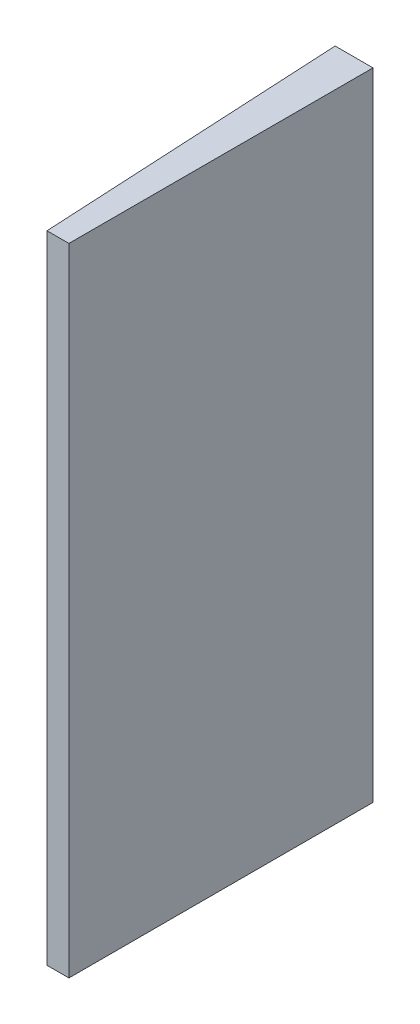
ISO-10303-21;
HEADER;
FILE_DESCRIPTION(('STEP AP214'),'2;1');
FILE_NAME('part.step','',(''),(''),'','','');
FILE_SCHEMA(('AUTOMOTIVE_DESIGN { 1 0 10303 214 1 1 1 1 }'));
ENDSEC;
DATA;
#1=APPLICATION_CONTEXT('core data for automotive mechanical design processes');
#2=APPLICATION_PROTOCOL_DEFINITION('international standard','automotive_design',2000,#1);
#3=PRODUCT_CONTEXT('',#1,'mechanical');
#4=PRODUCT('Part','Part','',(#3));
#5=PRODUCT_RELATED_PRODUCT_CATEGORY('part','',(#4));
#6=PRODUCT_DEFINITION_FORMATION('','',#4);
#7=PRODUCT_DEFINITION_CONTEXT('part definition',#1,'design');
#8=PRODUCT_DEFINITION('design','',#6,#7);
#9=PRODUCT_DEFINITION_SHAPE('','',#8);
#10=(LENGTH_UNIT() NAMED_UNIT(*) SI_UNIT(.MILLI.,.METRE.));
#11=(NAMED_UNIT(*) PLANE_ANGLE_UNIT() SI_UNIT($,.RADIAN.));
#12=(NAMED_UNIT(*) SI_UNIT($,.STERADIAN.) SOLID_ANGLE_UNIT());
#13=UNCERTAINTY_MEASURE_WITH_UNIT(LENGTH_MEASURE(1.E-05),#10,'distance_accuracy_value','');
#14=(GEOMETRIC_REPRESENTATION_CONTEXT(3) GLOBAL_UNCERTAINTY_ASSIGNED_CONTEXT((#13)) GLOBAL_UNIT_ASSIGNED_CONTEXT((#10,
#11,#12)) REPRESENTATION_CONTEXT('',''));
#15=CARTESIAN_POINT('',(0.,0.,0.));
#16=DIRECTION('',(0.,0.,1.));
#17=DIRECTION('',(1.,0.,0.));
#18=AXIS2_PLACEMENT_3D('',#15,#16,#17);
#19=CARTESIAN_POINT('',(0.,42.,-20.075));
#20=DIRECTION('',(0.,0.,1.));
#21=DIRECTION('',(1.,0.,0.));
#22=AXIS2_PLACEMENT_3D('',#19,#20,#21);
#23=PLANE('',#22);
#24=DIRECTION('',(-1.,0.,0.));
#25=VECTOR('',#24,1.);
#26=CARTESIAN_POINT('',(0.,-42.,-20.075));
#27=LINE('',#26,#25);
#28=CARTESIAN_POINT('',(0.,-42.,-20.075));
#29=VERTEX_POINT('',#28);
#30=CARTESIAN_POINT('',(-5.,-42.,-20.075));
#31=VERTEX_POINT('',#30);
#32=EDGE_CURVE('E106',#29,#31,#27,.T.);
#33=ORIENTED_EDGE('',*,*,#32,.T.);
#34=DIRECTION('',(0.,-1.,0.));
#35=VECTOR('',#34,1.);
#36=CARTESIAN_POINT('',(-5.,42.,-20.075));
#37=LINE('',#36,#35);
#38=CARTESIAN_POINT('',(-5.,42.,-20.075));
#39=VERTEX_POINT('',#38);
#40=EDGE_CURVE('E97',#39,#31,#37,.T.);
#41=ORIENTED_EDGE('',*,*,#40,.F.);
#42=DIRECTION('',(-1.,0.,0.));
#43=VECTOR('',#42,1.);
#44=CARTESIAN_POINT('',(0.,42.,-20.075));
#45=LINE('',#44,#43);
#46=CARTESIAN_POINT('',(0.,42.,-20.075));
#47=VERTEX_POINT('',#46);
#48=EDGE_CURVE('E91',#47,#39,#45,.T.);
#49=ORIENTED_EDGE('',*,*,#48,.F.);
#50=DIRECTION('',(0.,-1.,0.));
#51=VECTOR('',#50,1.);
#52=CARTESIAN_POINT('',(0.,42.,-20.075));
#53=LINE('',#52,#51);
#54=EDGE_CURVE('E102',#47,#29,#53,.T.);
#55=ORIENTED_EDGE('',*,*,#54,.T.);
#56=EDGE_LOOP('',(#33,#41,#49,#55));
#57=FACE_BOUND('',#56,.T.);
#58=ADVANCED_FACE('F39',(#57),#23,.F.);
#59=CARTESIAN_POINT('',(-5.,42.,-20.075));
#60=DIRECTION('',(0.998629534754574,0.,-0.0523359562429404));
#61=DIRECTION('',(-0.0523359562429404,0.,-0.998629534754574));
#62=AXIS2_PLACEMENT_3D('',#59,#60,#61);
#63=PLANE('',#62);
#64=CARTESIAN_POINT('',(-4.20449346510731,29.8956518577535,-4.89583107173047));
#65=DIRECTION('',(0.998629534754574,0.,-0.0523359562429404));
#66=DIRECTION('',(-0.0523359562429404,0.,-0.998629534754574));
#67=AXIS2_PLACEMENT_3D('',#64,#65,#66);
#68=CIRCLE('',#67,3.3);
#69=CARTESIAN_POINT('',(-4.37720212070901,29.8956518577535,-8.19130853642057));
#70=VERTEX_POINT('',#69);
#71=EDGE_CURVE('E11',#70,#70,#68,.F.);
#72=ORIENTED_EDGE('',*,*,#71,.F.);
#73=EDGE_LOOP('',(#72));
#74=FACE_BOUND('',#73,.T.);
#75=CARTESIAN_POINT('',(-4.20449346510731,-29.8956518577535,-4.89583107173047));
#76=DIRECTION('',(0.998629534754574,0.,-0.0523359562429404));
#77=DIRECTION('',(-0.0523359562429404,0.,-0.998629534754574));
#78=AXIS2_PLACEMENT_3D('',#75,#76,#77);
#79=CIRCLE('',#78,3.3);
#80=CARTESIAN_POINT('',(-4.37720212070901,-29.8956518577535,-8.19130853642057));
#81=VERTEX_POINT('',#80);
#82=EDGE_CURVE('E47',#81,#81,#79,.F.);
#83=ORIENTED_EDGE('',*,*,#82,.F.);
#84=EDGE_LOOP('',(#83));
#85=FACE_BOUND('',#84,.T.);
#86=DIRECTION('',(0.0523359562429404,0.,0.998629534754574));
#87=VECTOR('',#86,1.);
#88=CARTESIAN_POINT('',(-5.,-42.,-20.075));
#89=LINE('',#88,#87);
#90=CARTESIAN_POINT('',(-2.89582766178603,-42.,20.075));
#91=VERTEX_POINT('',#90);
#92=EDGE_CURVE('E96',#31,#91,#89,.T.);
#93=ORIENTED_EDGE('',*,*,#92,.T.);
#94=DIRECTION('',(0.,-1.,0.));
#95=VECTOR('',#94,1.);
#96=CARTESIAN_POINT('',(-2.89582766178603,42.,20.075));
#97=LINE('',#96,#95);
#98=CARTESIAN_POINT('',(-2.89582766178603,42.,20.075));
#99=VERTEX_POINT('',#98);
#100=EDGE_CURVE('E94',#99,#91,#97,.T.);
#101=ORIENTED_EDGE('',*,*,#100,.F.);
#102=DIRECTION('',(0.0523359562429404,0.,0.998629534754574));
#103=VECTOR('',#102,1.);
#104=CARTESIAN_POINT('',(-5.,42.,-20.075));
#105=LINE('',#104,#103);
#106=EDGE_CURVE('E86',#39,#99,#105,.T.);
#107=ORIENTED_EDGE('',*,*,#106,.F.);
#108=ORIENTED_EDGE('',*,*,#40,.T.);
#109=EDGE_LOOP('',(#93,#101,#107,#108));
#110=FACE_BOUND('',#109,.T.);
#111=ADVANCED_FACE('F95',(#74,#85,#110),#63,.F.);
#112=CARTESIAN_POINT('',(-2.89582766178603,42.,20.075));
#113=DIRECTION('',(0.,0.,-1.));
#114=DIRECTION('',(-1.,0.,0.));
#115=AXIS2_PLACEMENT_3D('',#112,#113,#114);
#116=PLANE('',#115);
#117=DIRECTION('',(1.,0.,0.));
#118=VECTOR('',#117,1.);
#119=CARTESIAN_POINT('',(-2.89582766178603,-42.,20.075));
#120=LINE('',#119,#118);
#121=CARTESIAN_POINT('',(0.,-42.,20.075));
#122=VERTEX_POINT('',#121);
#123=EDGE_CURVE('E72',#91,#122,#120,.T.);
#124=ORIENTED_EDGE('',*,*,#123,.T.);
#125=DIRECTION('',(0.,-1.,0.));
#126=VECTOR('',#125,1.);
#127=CARTESIAN_POINT('',(0.,42.,20.075));
#128=LINE('',#127,#126);
#129=CARTESIAN_POINT('',(0.,42.,20.075));
#130=VERTEX_POINT('',#129);
#131=EDGE_CURVE('E98',#130,#122,#128,.T.);
#132=ORIENTED_EDGE('',*,*,#131,.F.);
#133=DIRECTION('',(1.,0.,0.));
#134=VECTOR('',#133,1.);
#135=CARTESIAN_POINT('',(-2.89582766178603,42.,20.075));
#136=LINE('',#135,#134);
#137=EDGE_CURVE('E89',#99,#130,#136,.T.);
#138=ORIENTED_EDGE('',*,*,#137,.F.);
#139=ORIENTED_EDGE('',*,*,#100,.T.);
#140=EDGE_LOOP('',(#124,#132,#138,#139));
#141=FACE_BOUND('',#140,.T.);
#142=ADVANCED_FACE('F100',(#141),#116,.F.);
#143=CARTESIAN_POINT('',(0.,42.,-20.075));
#144=DIRECTION('',(-1.,0.,0.));
#145=DIRECTION('',(0.,0.,1.));
#146=AXIS2_PLACEMENT_3D('',#143,#144,#145);
#147=PLANE('',#146);
#148=DIRECTION('',(0.,0.,-1.));
#149=VECTOR('',#148,1.);
#150=CARTESIAN_POINT('',(0.,-42.,-20.075));
#151=LINE('',#150,#149);
#152=EDGE_CURVE('E78',#122,#29,#151,.T.);
#153=ORIENTED_EDGE('',*,*,#152,.T.);
#154=ORIENTED_EDGE('',*,*,#54,.F.);
#155=DIRECTION('',(0.,0.,-1.));
#156=VECTOR('',#155,1.);
#157=CARTESIAN_POINT('',(0.,42.,-20.075));
#158=LINE('',#157,#156);
#159=EDGE_CURVE('E55',#130,#47,#158,.T.);
#160=ORIENTED_EDGE('',*,*,#159,.F.);
#161=ORIENTED_EDGE('',*,*,#131,.T.);
#162=EDGE_LOOP('',(#153,#154,#160,#161));
#163=FACE_BOUND('',#162,.T.);
#164=ADVANCED_FACE('F127',(#163),#147,.F.);
#165=CARTESIAN_POINT('',(0.,42.,0.));
#166=DIRECTION('',(0.,1.,0.));
#167=DIRECTION('',(0.,0.,1.));
#168=AXIS2_PLACEMENT_3D('',#165,#166,#167);
#169=PLANE('',#168);
#170=ORIENTED_EDGE('',*,*,#48,.T.);
#171=ORIENTED_EDGE('',*,*,#106,.T.);
#172=ORIENTED_EDGE('',*,*,#137,.T.);
#173=ORIENTED_EDGE('',*,*,#159,.T.);
#174=EDGE_LOOP('',(#170,#171,#172,#173));
#175=FACE_BOUND('',#174,.T.);
#176=ADVANCED_FACE('F87',(#175),#169,.T.);
#177=CARTESIAN_POINT('',(0.,-42.,0.));
#178=DIRECTION('',(0.,1.,0.));
#179=DIRECTION('',(0.,0.,1.));
#180=AXIS2_PLACEMENT_3D('',#177,#178,#179);
#181=PLANE('',#180);
#182=ORIENTED_EDGE('',*,*,#32,.F.);
#183=ORIENTED_EDGE('',*,*,#152,.F.);
#184=ORIENTED_EDGE('',*,*,#123,.F.);
#185=ORIENTED_EDGE('',*,*,#92,.F.);
#186=EDGE_LOOP('',(#182,#183,#184,#185));
#187=FACE_BOUND('',#186,.T.);
#188=ADVANCED_FACE('F135',(#187),#181,.F.);
#189=CARTESIAN_POINT('',(-6.00202662766554,-29.8956518577535,-4.80162635049318));
#190=DIRECTION('',(0.998629534754574,0.,-0.0523359562429404));
#191=DIRECTION('',(-0.0523359562429404,0.,-0.998629534754574));
#192=AXIS2_PLACEMENT_3D('',#189,#190,#191);
#193=CYLINDRICAL_SURFACE('',#192,3.3);
#194=CARTESIAN_POINT('',(-6.00202662766554,-29.8956518577535,-4.80162635049318));
#195=DIRECTION('',(-0.998629534754574,0.,0.0523359562429404));
#196=DIRECTION('',(0.0523359562429404,0.,0.998629534754574));
#197=AXIS2_PLACEMENT_3D('',#194,#195,#196);
#198=CIRCLE('',#197,3.3);
#199=CARTESIAN_POINT('',(-5.82931797206384,-29.8956518577535,-1.50614888580309));
#200=VERTEX_POINT('',#199);
#201=EDGE_CURVE('E109',#200,#200,#198,.T.);
#202=ORIENTED_EDGE('',*,*,#201,.F.);
#203=EDGE_LOOP('',(#202));
#204=FACE_BOUND('',#203,.T.);
#205=ORIENTED_EDGE('',*,*,#82,.T.);
#206=EDGE_LOOP('',(#205));
#207=FACE_BOUND('',#206,.T.);
#208=ADVANCED_FACE('F118',(#204,#207),#193,.T.);
#209=CARTESIAN_POINT('',(-6.00202662766554,-29.8956518577535,-4.80162635049318));
#210=DIRECTION('',(-0.998629534754574,0.,0.0523359562429404));
#211=DIRECTION('',(0.0523359562429404,0.,0.998629534754574));
#212=AXIS2_PLACEMENT_3D('',#209,#210,#211);
#213=PLANE('',#212);
#214=ORIENTED_EDGE('',*,*,#201,.T.);
#215=EDGE_LOOP('',(#214));
#216=FACE_BOUND('',#215,.T.);
#217=ADVANCED_FACE('F141',(#216),#213,.T.);
#218=CARTESIAN_POINT('',(-6.00202662766554,29.8956518577535,-4.80162635049318));
#219=DIRECTION('',(0.998629534754574,0.,-0.0523359562429404));
#220=DIRECTION('',(-0.0523359562429404,0.,-0.998629534754574));
#221=AXIS2_PLACEMENT_3D('',#218,#219,#220);
#222=CYLINDRICAL_SURFACE('',#221,3.3);
#223=CARTESIAN_POINT('',(-6.00202662766554,29.8956518577535,-4.80162635049318));
#224=DIRECTION('',(-0.998629534754574,0.,0.0523359562429404));
#225=DIRECTION('',(0.0523359562429404,0.,0.998629534754574));
#226=AXIS2_PLACEMENT_3D('',#223,#224,#225);
#227=CIRCLE('',#226,3.3);
#228=CARTESIAN_POINT('',(-5.82931797206384,29.8956518577535,-1.50614888580309));
#229=VERTEX_POINT('',#228);
#230=EDGE_CURVE('E158',#229,#229,#227,.T.);
#231=ORIENTED_EDGE('',*,*,#230,.F.);
#232=EDGE_LOOP('',(#231));
#233=FACE_BOUND('',#232,.T.);
#234=ORIENTED_EDGE('',*,*,#71,.T.);
#235=EDGE_LOOP('',(#234));
#236=FACE_BOUND('',#235,.T.);
#237=ADVANCED_FACE('F145',(#233,#236),#222,.T.);
#238=CARTESIAN_POINT('',(-6.00202662766554,29.8956518577535,-4.80162635049318));
#239=DIRECTION('',(-0.998629534754574,0.,0.0523359562429404));
#240=DIRECTION('',(0.0523359562429404,0.,0.998629534754574));
#241=AXIS2_PLACEMENT_3D('',#238,#239,#240);
#242=PLANE('',#241);
#243=ORIENTED_EDGE('',*,*,#230,.T.);
#244=EDGE_LOOP('',(#243));
#245=FACE_BOUND('',#244,.T.);
#246=ADVANCED_FACE('F147',(#245),#242,.T.);
#247=CLOSED_SHELL('',(#58,#111,#142,#164,#176,#188,#208,#217,#237,#246));
#248=MANIFOLD_SOLID_BREP('B2',#247);
#249=ADVANCED_BREP_SHAPE_REPRESENTATION('',(#18,#248),#14);
#250=SHAPE_DEFINITION_REPRESENTATION(#9,#249);
ENDSEC;
END-ISO-10303-21;
